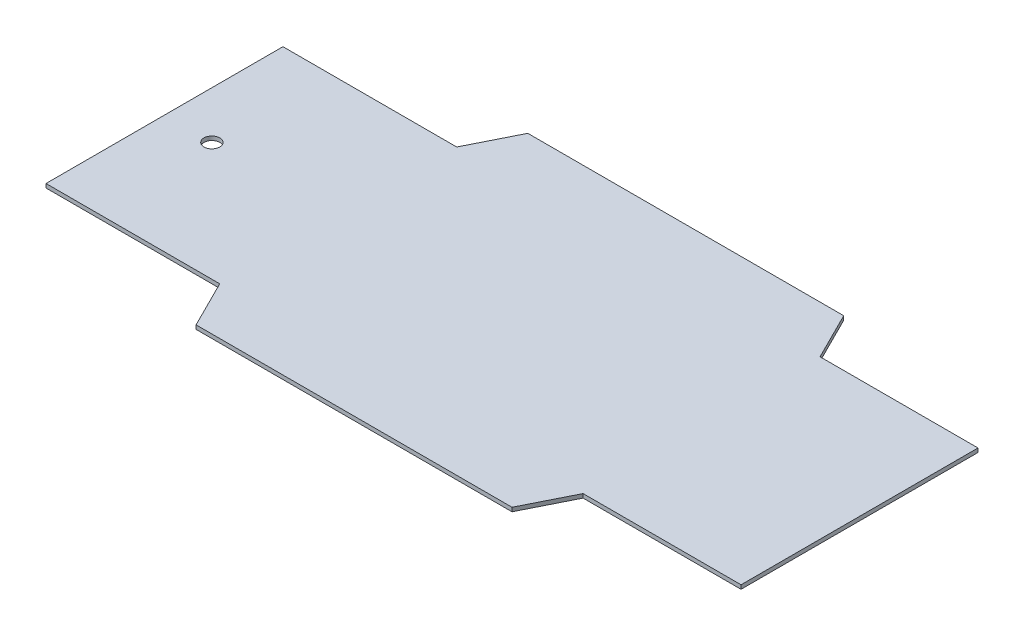
ISO-10303-21;
HEADER;
FILE_DESCRIPTION(('STEP AP214'),'2;1');
FILE_NAME('part.step','',(''),(''),'','','');
FILE_SCHEMA(('AUTOMOTIVE_DESIGN { 1 0 10303 214 1 1 1 1 }'));
ENDSEC;
DATA;
#1=APPLICATION_CONTEXT('core data for automotive mechanical design processes');
#2=APPLICATION_PROTOCOL_DEFINITION('international standard','automotive_design',2000,#1);
#3=PRODUCT_CONTEXT('',#1,'mechanical');
#4=PRODUCT('Part','Part','',(#3));
#5=PRODUCT_RELATED_PRODUCT_CATEGORY('part','',(#4));
#6=PRODUCT_DEFINITION_FORMATION('','',#4);
#7=PRODUCT_DEFINITION_CONTEXT('part definition',#1,'design');
#8=PRODUCT_DEFINITION('design','',#6,#7);
#9=PRODUCT_DEFINITION_SHAPE('','',#8);
#10=(LENGTH_UNIT() NAMED_UNIT(*) SI_UNIT(.MILLI.,.METRE.));
#11=(NAMED_UNIT(*) PLANE_ANGLE_UNIT() SI_UNIT($,.RADIAN.));
#12=(NAMED_UNIT(*) SI_UNIT($,.STERADIAN.) SOLID_ANGLE_UNIT());
#13=UNCERTAINTY_MEASURE_WITH_UNIT(LENGTH_MEASURE(1.E-05),#10,'distance_accuracy_value','');
#14=(GEOMETRIC_REPRESENTATION_CONTEXT(3) GLOBAL_UNCERTAINTY_ASSIGNED_CONTEXT((#13)) GLOBAL_UNIT_ASSIGNED_CONTEXT((#10,
#11,#12)) REPRESENTATION_CONTEXT('',''));
#15=CARTESIAN_POINT('',(0.,0.,0.));
#16=DIRECTION('',(0.,0.,1.));
#17=DIRECTION('',(1.,0.,0.));
#18=AXIS2_PLACEMENT_3D('',#15,#16,#17);
#19=CARTESIAN_POINT('',(279.4,1.5875,-95.25));
#20=DIRECTION('',(-1.,0.,0.));
#21=DIRECTION('',(0.,0.,1.));
#22=AXIS2_PLACEMENT_3D('',#19,#20,#21);
#23=PLANE('',#22);
#24=DIRECTION('',(0.,0.,-1.));
#25=VECTOR('',#24,1.);
#26=CARTESIAN_POINT('',(279.4,-1.5875,-95.25));
#27=LINE('',#26,#25);
#28=CARTESIAN_POINT('',(279.4,-1.5875,95.25));
#29=VERTEX_POINT('',#28);
#30=CARTESIAN_POINT('',(279.4,-1.5875,-95.25));
#31=VERTEX_POINT('',#30);
#32=EDGE_CURVE('E156',#29,#31,#27,.T.);
#33=ORIENTED_EDGE('',*,*,#32,.T.);
#34=DIRECTION('',(0.,-1.,0.));
#35=VECTOR('',#34,1.);
#36=CARTESIAN_POINT('',(279.4,1.5875,-95.25));
#37=LINE('',#36,#35);
#38=CARTESIAN_POINT('',(279.4,1.5875,-95.25));
#39=VERTEX_POINT('',#38);
#40=EDGE_CURVE('E11',#39,#31,#37,.T.);
#41=ORIENTED_EDGE('',*,*,#40,.F.);
#42=DIRECTION('',(0.,0.,-1.));
#43=VECTOR('',#42,1.);
#44=CARTESIAN_POINT('',(279.4,1.5875,-95.25));
#45=LINE('',#44,#43);
#46=CARTESIAN_POINT('',(279.4,1.5875,95.25));
#47=VERTEX_POINT('',#46);
#48=EDGE_CURVE('E178',#47,#39,#45,.T.);
#49=ORIENTED_EDGE('',*,*,#48,.F.);
#50=DIRECTION('',(0.,-1.,0.));
#51=VECTOR('',#50,1.);
#52=CARTESIAN_POINT('',(279.4,1.5875,95.25));
#53=LINE('',#52,#51);
#54=EDGE_CURVE('E152',#47,#29,#53,.T.);
#55=ORIENTED_EDGE('',*,*,#54,.T.);
#56=EDGE_LOOP('',(#33,#41,#49,#55));
#57=FACE_BOUND('',#56,.T.);
#58=ADVANCED_FACE('F35',(#57),#23,.F.);
#59=CARTESIAN_POINT('',(152.4,1.5875,-95.25));
#60=DIRECTION('',(0.,0.,1.));
#61=DIRECTION('',(1.,0.,0.));
#62=AXIS2_PLACEMENT_3D('',#59,#60,#61);
#63=PLANE('',#62);
#64=DIRECTION('',(-1.,0.,0.));
#65=VECTOR('',#64,1.);
#66=CARTESIAN_POINT('',(152.4,-1.5875,-95.25));
#67=LINE('',#66,#65);
#68=CARTESIAN_POINT('',(152.4,-1.5875,-95.25));
#69=VERTEX_POINT('',#68);
#70=EDGE_CURVE('E159',#31,#69,#67,.T.);
#71=ORIENTED_EDGE('',*,*,#70,.T.);
#72=DIRECTION('',(0.,-1.,0.));
#73=VECTOR('',#72,1.);
#74=CARTESIAN_POINT('',(152.4,1.5875,-95.25));
#75=LINE('',#74,#73);
#76=CARTESIAN_POINT('',(152.4,1.5875,-95.25));
#77=VERTEX_POINT('',#76);
#78=EDGE_CURVE('E44',#77,#69,#75,.T.);
#79=ORIENTED_EDGE('',*,*,#78,.F.);
#80=DIRECTION('',(-1.,0.,0.));
#81=VECTOR('',#80,1.);
#82=CARTESIAN_POINT('',(152.4,1.5875,-95.25));
#83=LINE('',#82,#81);
#84=EDGE_CURVE('E107',#39,#77,#83,.T.);
#85=ORIENTED_EDGE('',*,*,#84,.F.);
#86=ORIENTED_EDGE('',*,*,#40,.T.);
#87=EDGE_LOOP('',(#71,#79,#85,#86));
#88=FACE_BOUND('',#87,.T.);
#89=ADVANCED_FACE('F259',(#88),#63,.F.);
#90=CARTESIAN_POINT('',(133.35,1.5875,-133.35));
#91=DIRECTION('',(-0.894427190999916,0.,0.447213595499958));
#92=DIRECTION('',(0.447213595499958,0.,0.894427190999916));
#93=AXIS2_PLACEMENT_3D('',#90,#91,#92);
#94=PLANE('',#93);
#95=DIRECTION('',(-0.447213595499958,0.,-0.894427190999916));
#96=VECTOR('',#95,1.);
#97=CARTESIAN_POINT('',(133.35,-1.5875,-133.35));
#98=LINE('',#97,#96);
#99=CARTESIAN_POINT('',(133.35,-1.5875,-133.35));
#100=VERTEX_POINT('',#99);
#101=EDGE_CURVE('E161',#69,#100,#98,.T.);
#102=ORIENTED_EDGE('',*,*,#101,.T.);
#103=DIRECTION('',(0.,-1.,0.));
#104=VECTOR('',#103,1.);
#105=CARTESIAN_POINT('',(133.35,1.5875,-133.35));
#106=LINE('',#105,#104);
#107=CARTESIAN_POINT('',(133.35,1.5875,-133.35));
#108=VERTEX_POINT('',#107);
#109=EDGE_CURVE('E197',#108,#100,#106,.T.);
#110=ORIENTED_EDGE('',*,*,#109,.F.);
#111=DIRECTION('',(-0.447213595499958,0.,-0.894427190999916));
#112=VECTOR('',#111,1.);
#113=CARTESIAN_POINT('',(133.35,1.5875,-133.35));
#114=LINE('',#113,#112);
#115=EDGE_CURVE('E206',#77,#108,#114,.T.);
#116=ORIENTED_EDGE('',*,*,#115,.F.);
#117=ORIENTED_EDGE('',*,*,#78,.T.);
#118=EDGE_LOOP('',(#102,#110,#116,#117));
#119=FACE_BOUND('',#118,.T.);
#120=ADVANCED_FACE('F204',(#119),#94,.F.);
#121=CARTESIAN_POINT('',(-120.65,1.5875,-133.35));
#122=DIRECTION('',(0.,0.,1.));
#123=DIRECTION('',(1.,0.,0.));
#124=AXIS2_PLACEMENT_3D('',#121,#122,#123);
#125=PLANE('',#124);
#126=DIRECTION('',(-1.,0.,0.));
#127=VECTOR('',#126,1.);
#128=CARTESIAN_POINT('',(-120.65,-1.5875,-133.35));
#129=LINE('',#128,#127);
#130=CARTESIAN_POINT('',(-120.65,-1.5875,-133.35));
#131=VERTEX_POINT('',#130);
#132=EDGE_CURVE('E163',#100,#131,#129,.T.);
#133=ORIENTED_EDGE('',*,*,#132,.T.);
#134=DIRECTION('',(0.,-1.,0.));
#135=VECTOR('',#134,1.);
#136=CARTESIAN_POINT('',(-120.65,1.5875,-133.35));
#137=LINE('',#136,#135);
#138=CARTESIAN_POINT('',(-120.65,1.5875,-133.35));
#139=VERTEX_POINT('',#138);
#140=EDGE_CURVE('E194',#139,#131,#137,.T.);
#141=ORIENTED_EDGE('',*,*,#140,.F.);
#142=DIRECTION('',(-1.,0.,0.));
#143=VECTOR('',#142,1.);
#144=CARTESIAN_POINT('',(-120.65,1.5875,-133.35));
#145=LINE('',#144,#143);
#146=EDGE_CURVE('E224',#108,#139,#145,.T.);
#147=ORIENTED_EDGE('',*,*,#146,.F.);
#148=ORIENTED_EDGE('',*,*,#109,.T.);
#149=EDGE_LOOP('',(#133,#141,#147,#148));
#150=FACE_BOUND('',#149,.T.);
#151=ADVANCED_FACE('F215',(#150),#125,.F.);
#152=CARTESIAN_POINT('',(-139.7,1.5875,-95.25));
#153=DIRECTION('',(0.894427190999916,0.,0.447213595499958));
#154=DIRECTION('',(0.447213595499958,0.,-0.894427190999916));
#155=AXIS2_PLACEMENT_3D('',#152,#153,#154);
#156=PLANE('',#155);
#157=DIRECTION('',(-0.447213595499958,0.,0.894427190999916));
#158=VECTOR('',#157,1.);
#159=CARTESIAN_POINT('',(-139.7,-1.5875,-95.25));
#160=LINE('',#159,#158);
#161=CARTESIAN_POINT('',(-139.7,-1.5875,-95.25));
#162=VERTEX_POINT('',#161);
#163=EDGE_CURVE('E165',#131,#162,#160,.T.);
#164=ORIENTED_EDGE('',*,*,#163,.T.);
#165=DIRECTION('',(0.,-1.,0.));
#166=VECTOR('',#165,1.);
#167=CARTESIAN_POINT('',(-139.7,1.5875,-95.25));
#168=LINE('',#167,#166);
#169=CARTESIAN_POINT('',(-139.7,1.5875,-95.25));
#170=VERTEX_POINT('',#169);
#171=EDGE_CURVE('E191',#170,#162,#168,.T.);
#172=ORIENTED_EDGE('',*,*,#171,.F.);
#173=DIRECTION('',(-0.447213595499958,0.,0.894427190999916));
#174=VECTOR('',#173,1.);
#175=CARTESIAN_POINT('',(-139.7,1.5875,-95.25));
#176=LINE('',#175,#174);
#177=EDGE_CURVE('E221',#139,#170,#176,.T.);
#178=ORIENTED_EDGE('',*,*,#177,.F.);
#179=ORIENTED_EDGE('',*,*,#140,.T.);
#180=EDGE_LOOP('',(#164,#172,#178,#179));
#181=FACE_BOUND('',#180,.T.);
#182=ADVANCED_FACE('F219',(#181),#156,.F.);
#183=CARTESIAN_POINT('',(-279.4,1.5875,-95.25));
#184=DIRECTION('',(0.,0.,1.));
#185=DIRECTION('',(1.,0.,0.));
#186=AXIS2_PLACEMENT_3D('',#183,#184,#185);
#187=PLANE('',#186);
#188=DIRECTION('',(-1.,0.,0.));
#189=VECTOR('',#188,1.);
#190=CARTESIAN_POINT('',(-279.4,-1.5875,-95.25));
#191=LINE('',#190,#189);
#192=CARTESIAN_POINT('',(-279.4,-1.5875,-95.25));
#193=VERTEX_POINT('',#192);
#194=EDGE_CURVE('E167',#162,#193,#191,.T.);
#195=ORIENTED_EDGE('',*,*,#194,.T.);
#196=DIRECTION('',(0.,-1.,0.));
#197=VECTOR('',#196,1.);
#198=CARTESIAN_POINT('',(-279.4,1.5875,-95.25));
#199=LINE('',#198,#197);
#200=CARTESIAN_POINT('',(-279.4,1.5875,-95.25));
#201=VERTEX_POINT('',#200);
#202=EDGE_CURVE('E188',#201,#193,#199,.T.);
#203=ORIENTED_EDGE('',*,*,#202,.F.);
#204=DIRECTION('',(-1.,0.,0.));
#205=VECTOR('',#204,1.);
#206=CARTESIAN_POINT('',(-279.4,1.5875,-95.25));
#207=LINE('',#206,#205);
#208=EDGE_CURVE('E223',#170,#201,#207,.T.);
#209=ORIENTED_EDGE('',*,*,#208,.F.);
#210=ORIENTED_EDGE('',*,*,#171,.T.);
#211=EDGE_LOOP('',(#195,#203,#209,#210));
#212=FACE_BOUND('',#211,.T.);
#213=ADVANCED_FACE('F272',(#212),#187,.F.);
#214=CARTESIAN_POINT('',(-279.4,1.5875,-95.25));
#215=DIRECTION('',(1.,0.,0.));
#216=DIRECTION('',(0.,0.,-1.));
#217=AXIS2_PLACEMENT_3D('',#214,#215,#216);
#218=PLANE('',#217);
#219=DIRECTION('',(0.,0.,1.));
#220=VECTOR('',#219,1.);
#221=CARTESIAN_POINT('',(-279.4,-1.5875,-95.25));
#222=LINE('',#221,#220);
#223=CARTESIAN_POINT('',(-279.4,-1.5875,95.25));
#224=VERTEX_POINT('',#223);
#225=EDGE_CURVE('E169',#193,#224,#222,.T.);
#226=ORIENTED_EDGE('',*,*,#225,.T.);
#227=DIRECTION('',(0.,-1.,0.));
#228=VECTOR('',#227,1.);
#229=CARTESIAN_POINT('',(-279.4,1.5875,95.25));
#230=LINE('',#229,#228);
#231=CARTESIAN_POINT('',(-279.4,1.5875,95.25));
#232=VERTEX_POINT('',#231);
#233=EDGE_CURVE('E185',#232,#224,#230,.T.);
#234=ORIENTED_EDGE('',*,*,#233,.F.);
#235=DIRECTION('',(0.,0.,1.));
#236=VECTOR('',#235,1.);
#237=CARTESIAN_POINT('',(-279.4,1.5875,-95.25));
#238=LINE('',#237,#236);
#239=EDGE_CURVE('E226',#201,#232,#238,.T.);
#240=ORIENTED_EDGE('',*,*,#239,.F.);
#241=ORIENTED_EDGE('',*,*,#202,.T.);
#242=EDGE_LOOP('',(#226,#234,#240,#241));
#243=FACE_BOUND('',#242,.T.);
#244=ADVANCED_FACE('F275',(#243),#218,.F.);
#245=CARTESIAN_POINT('',(-279.4,1.5875,95.25));
#246=DIRECTION('',(0.,0.,-1.));
#247=DIRECTION('',(-1.,0.,0.));
#248=AXIS2_PLACEMENT_3D('',#245,#246,#247);
#249=PLANE('',#248);
#250=DIRECTION('',(1.,0.,0.));
#251=VECTOR('',#250,1.);
#252=CARTESIAN_POINT('',(-279.4,-1.5875,95.25));
#253=LINE('',#252,#251);
#254=CARTESIAN_POINT('',(-139.7,-1.5875,95.25));
#255=VERTEX_POINT('',#254);
#256=EDGE_CURVE('E171',#224,#255,#253,.T.);
#257=ORIENTED_EDGE('',*,*,#256,.T.);
#258=DIRECTION('',(0.,-1.,0.));
#259=VECTOR('',#258,1.);
#260=CARTESIAN_POINT('',(-139.7,1.5875,95.25));
#261=LINE('',#260,#259);
#262=CARTESIAN_POINT('',(-139.7,1.5875,95.25));
#263=VERTEX_POINT('',#262);
#264=EDGE_CURVE('E182',#263,#255,#261,.T.);
#265=ORIENTED_EDGE('',*,*,#264,.F.);
#266=DIRECTION('',(1.,0.,0.));
#267=VECTOR('',#266,1.);
#268=CARTESIAN_POINT('',(-279.4,1.5875,95.25));
#269=LINE('',#268,#267);
#270=EDGE_CURVE('E232',#232,#263,#269,.T.);
#271=ORIENTED_EDGE('',*,*,#270,.F.);
#272=ORIENTED_EDGE('',*,*,#233,.T.);
#273=EDGE_LOOP('',(#257,#265,#271,#272));
#274=FACE_BOUND('',#273,.T.);
#275=ADVANCED_FACE('F238',(#274),#249,.F.);
#276=CARTESIAN_POINT('',(-139.7,1.5875,95.25));
#277=DIRECTION('',(0.894427190999916,0.,-0.447213595499958));
#278=DIRECTION('',(-0.447213595499958,0.,-0.894427190999916));
#279=AXIS2_PLACEMENT_3D('',#276,#277,#278);
#280=PLANE('',#279);
#281=DIRECTION('',(0.447213595499958,0.,0.894427190999916));
#282=VECTOR('',#281,1.);
#283=CARTESIAN_POINT('',(-139.7,-1.5875,95.25));
#284=LINE('',#283,#282);
#285=CARTESIAN_POINT('',(-120.65,-1.5875,133.35));
#286=VERTEX_POINT('',#285);
#287=EDGE_CURVE('E173',#255,#286,#284,.T.);
#288=ORIENTED_EDGE('',*,*,#287,.T.);
#289=DIRECTION('',(0.,-1.,0.));
#290=VECTOR('',#289,1.);
#291=CARTESIAN_POINT('',(-120.65,1.5875,133.35));
#292=LINE('',#291,#290);
#293=CARTESIAN_POINT('',(-120.65,1.5875,133.35));
#294=VERTEX_POINT('',#293);
#295=EDGE_CURVE('E147',#294,#286,#292,.T.);
#296=ORIENTED_EDGE('',*,*,#295,.F.);
#297=DIRECTION('',(0.447213595499958,0.,0.894427190999916));
#298=VECTOR('',#297,1.);
#299=CARTESIAN_POINT('',(-139.7,1.5875,95.25));
#300=LINE('',#299,#298);
#301=EDGE_CURVE('E138',#263,#294,#300,.T.);
#302=ORIENTED_EDGE('',*,*,#301,.F.);
#303=ORIENTED_EDGE('',*,*,#264,.T.);
#304=EDGE_LOOP('',(#288,#296,#302,#303));
#305=FACE_BOUND('',#304,.T.);
#306=ADVANCED_FACE('F242',(#305),#280,.F.);
#307=CARTESIAN_POINT('',(-120.65,1.5875,133.35));
#308=DIRECTION('',(0.,0.,-1.));
#309=DIRECTION('',(-1.,0.,0.));
#310=AXIS2_PLACEMENT_3D('',#307,#308,#309);
#311=PLANE('',#310);
#312=DIRECTION('',(1.,0.,0.));
#313=VECTOR('',#312,1.);
#314=CARTESIAN_POINT('',(-120.65,-1.5875,133.35));
#315=LINE('',#314,#313);
#316=CARTESIAN_POINT('',(133.35,-1.5875,133.35));
#317=VERTEX_POINT('',#316);
#318=EDGE_CURVE('E146',#286,#317,#315,.T.);
#319=ORIENTED_EDGE('',*,*,#318,.T.);
#320=DIRECTION('',(0.,-1.,0.));
#321=VECTOR('',#320,1.);
#322=CARTESIAN_POINT('',(133.35,1.5875,133.35));
#323=LINE('',#322,#321);
#324=CARTESIAN_POINT('',(133.35,1.5875,133.35));
#325=VERTEX_POINT('',#324);
#326=EDGE_CURVE('E143',#325,#317,#323,.T.);
#327=ORIENTED_EDGE('',*,*,#326,.F.);
#328=DIRECTION('',(1.,0.,0.));
#329=VECTOR('',#328,1.);
#330=CARTESIAN_POINT('',(-120.65,1.5875,133.35));
#331=LINE('',#330,#329);
#332=EDGE_CURVE('E132',#294,#325,#331,.T.);
#333=ORIENTED_EDGE('',*,*,#332,.F.);
#334=ORIENTED_EDGE('',*,*,#295,.T.);
#335=EDGE_LOOP('',(#319,#327,#333,#334));
#336=FACE_BOUND('',#335,.T.);
#337=ADVANCED_FACE('F144',(#336),#311,.F.);
#338=CARTESIAN_POINT('',(133.35,1.5875,133.35));
#339=DIRECTION('',(-0.894427190999916,0.,-0.447213595499958));
#340=DIRECTION('',(-0.447213595499958,0.,0.894427190999916));
#341=AXIS2_PLACEMENT_3D('',#338,#339,#340);
#342=PLANE('',#341);
#343=DIRECTION('',(0.447213595499958,0.,-0.894427190999916));
#344=VECTOR('',#343,1.);
#345=CARTESIAN_POINT('',(133.35,-1.5875,133.35));
#346=LINE('',#345,#344);
#347=CARTESIAN_POINT('',(152.4,-1.5875,95.25));
#348=VERTEX_POINT('',#347);
#349=EDGE_CURVE('E93',#317,#348,#346,.T.);
#350=ORIENTED_EDGE('',*,*,#349,.T.);
#351=DIRECTION('',(0.,-1.,0.));
#352=VECTOR('',#351,1.);
#353=CARTESIAN_POINT('',(152.4,1.5875,95.25));
#354=LINE('',#353,#352);
#355=CARTESIAN_POINT('',(152.4,1.5875,95.25));
#356=VERTEX_POINT('',#355);
#357=EDGE_CURVE('E148',#356,#348,#354,.T.);
#358=ORIENTED_EDGE('',*,*,#357,.F.);
#359=DIRECTION('',(0.447213595499958,0.,-0.894427190999916));
#360=VECTOR('',#359,1.);
#361=CARTESIAN_POINT('',(133.35,1.5875,133.35));
#362=LINE('',#361,#360);
#363=EDGE_CURVE('E136',#325,#356,#362,.T.);
#364=ORIENTED_EDGE('',*,*,#363,.F.);
#365=ORIENTED_EDGE('',*,*,#326,.T.);
#366=EDGE_LOOP('',(#350,#358,#364,#365));
#367=FACE_BOUND('',#366,.T.);
#368=ADVANCED_FACE('F150',(#367),#342,.F.);
#369=CARTESIAN_POINT('',(152.4,1.5875,95.25));
#370=DIRECTION('',(0.,0.,-1.));
#371=DIRECTION('',(-1.,0.,0.));
#372=AXIS2_PLACEMENT_3D('',#369,#370,#371);
#373=PLANE('',#372);
#374=DIRECTION('',(1.,0.,0.));
#375=VECTOR('',#374,1.);
#376=CARTESIAN_POINT('',(152.4,-1.5875,95.25));
#377=LINE('',#376,#375);
#378=EDGE_CURVE('E99',#348,#29,#377,.T.);
#379=ORIENTED_EDGE('',*,*,#378,.T.);
#380=ORIENTED_EDGE('',*,*,#54,.F.);
#381=DIRECTION('',(1.,0.,0.));
#382=VECTOR('',#381,1.);
#383=CARTESIAN_POINT('',(152.4,1.5875,95.25));
#384=LINE('',#383,#382);
#385=EDGE_CURVE('E52',#356,#47,#384,.T.);
#386=ORIENTED_EDGE('',*,*,#385,.F.);
#387=ORIENTED_EDGE('',*,*,#357,.T.);
#388=EDGE_LOOP('',(#379,#380,#386,#387));
#389=FACE_BOUND('',#388,.T.);
#390=ADVANCED_FACE('F246',(#389),#373,.F.);
#391=CARTESIAN_POINT('',(0.,1.5875,0.));
#392=DIRECTION('',(0.,1.,0.));
#393=DIRECTION('',(0.,0.,1.));
#394=AXIS2_PLACEMENT_3D('',#391,#392,#393);
#395=PLANE('',#394);
#396=CARTESIAN_POINT('',(-241.3,1.5875,0.));
#397=DIRECTION('',(0.,1.,0.));
#398=DIRECTION('',(0.,0.,1.));
#399=AXIS2_PLACEMENT_3D('',#396,#397,#398);
#400=CIRCLE('',#399,6.35);
#401=CARTESIAN_POINT('',(-241.3,1.5875,6.34999999999997));
#402=VERTEX_POINT('',#401);
#403=EDGE_CURVE('E327',#402,#402,#400,.T.);
#404=ORIENTED_EDGE('',*,*,#403,.F.);
#405=EDGE_LOOP('',(#404));
#406=FACE_BOUND('',#405,.T.);
#407=ORIENTED_EDGE('',*,*,#48,.T.);
#408=ORIENTED_EDGE('',*,*,#84,.T.);
#409=ORIENTED_EDGE('',*,*,#115,.T.);
#410=ORIENTED_EDGE('',*,*,#146,.T.);
#411=ORIENTED_EDGE('',*,*,#177,.T.);
#412=ORIENTED_EDGE('',*,*,#208,.T.);
#413=ORIENTED_EDGE('',*,*,#239,.T.);
#414=ORIENTED_EDGE('',*,*,#270,.T.);
#415=ORIENTED_EDGE('',*,*,#301,.T.);
#416=ORIENTED_EDGE('',*,*,#332,.T.);
#417=ORIENTED_EDGE('',*,*,#363,.T.);
#418=ORIENTED_EDGE('',*,*,#385,.T.);
#419=EDGE_LOOP('',(#407,#408,#409,#410,#411,#412,#413,#414,#415,#416,#417,#418));
#420=FACE_BOUND('',#419,.T.);
#421=ADVANCED_FACE('F134',(#406,#420),#395,.T.);
#422=CARTESIAN_POINT('',(0.,-1.5875,0.));
#423=DIRECTION('',(0.,1.,0.));
#424=DIRECTION('',(0.,0.,1.));
#425=AXIS2_PLACEMENT_3D('',#422,#423,#424);
#426=PLANE('',#425);
#427=CARTESIAN_POINT('',(-241.3,-1.5875,0.));
#428=DIRECTION('',(0.,1.,0.));
#429=DIRECTION('',(0.,0.,1.));
#430=AXIS2_PLACEMENT_3D('',#427,#428,#429);
#431=CIRCLE('',#430,6.35);
#432=CARTESIAN_POINT('',(-241.3,-1.5875,6.34999999999997));
#433=VERTEX_POINT('',#432);
#434=EDGE_CURVE('E38',#433,#433,#431,.T.);
#435=ORIENTED_EDGE('',*,*,#434,.T.);
#436=EDGE_LOOP('',(#435));
#437=FACE_BOUND('',#436,.T.);
#438=ORIENTED_EDGE('',*,*,#32,.F.);
#439=ORIENTED_EDGE('',*,*,#378,.F.);
#440=ORIENTED_EDGE('',*,*,#349,.F.);
#441=ORIENTED_EDGE('',*,*,#318,.F.);
#442=ORIENTED_EDGE('',*,*,#287,.F.);
#443=ORIENTED_EDGE('',*,*,#256,.F.);
#444=ORIENTED_EDGE('',*,*,#225,.F.);
#445=ORIENTED_EDGE('',*,*,#194,.F.);
#446=ORIENTED_EDGE('',*,*,#163,.F.);
#447=ORIENTED_EDGE('',*,*,#132,.F.);
#448=ORIENTED_EDGE('',*,*,#101,.F.);
#449=ORIENTED_EDGE('',*,*,#70,.F.);
#450=EDGE_LOOP('',(#438,#439,#440,#441,#442,#443,#444,#445,#446,#447,#448,#449));
#451=FACE_BOUND('',#450,.T.);
#452=ADVANCED_FACE('F210',(#437,#451),#426,.F.);
#453=CARTESIAN_POINT('',(-241.3,-3.4925,0.));
#454=DIRECTION('',(0.,1.,0.));
#455=DIRECTION('',(0.,0.,1.));
#456=AXIS2_PLACEMENT_3D('',#453,#454,#455);
#457=CYLINDRICAL_SURFACE('',#456,6.35);
#458=ORIENTED_EDGE('',*,*,#403,.T.);
#459=EDGE_LOOP('',(#458));
#460=FACE_BOUND('',#459,.T.);
#461=ORIENTED_EDGE('',*,*,#434,.F.);
#462=EDGE_LOOP('',(#461));
#463=FACE_BOUND('',#462,.T.);
#464=ADVANCED_FACE('F308',(#460,#463),#457,.F.);
#465=CLOSED_SHELL('',(#58,#89,#120,#151,#182,#213,#244,#275,#306,#337,#368,#390,#421,#452,#464));
#466=MANIFOLD_SOLID_BREP('B2',#465);
#467=ADVANCED_BREP_SHAPE_REPRESENTATION('',(#18,#466),#14);
#468=SHAPE_DEFINITION_REPRESENTATION(#9,#467);
ENDSEC;
END-ISO-10303-21;
